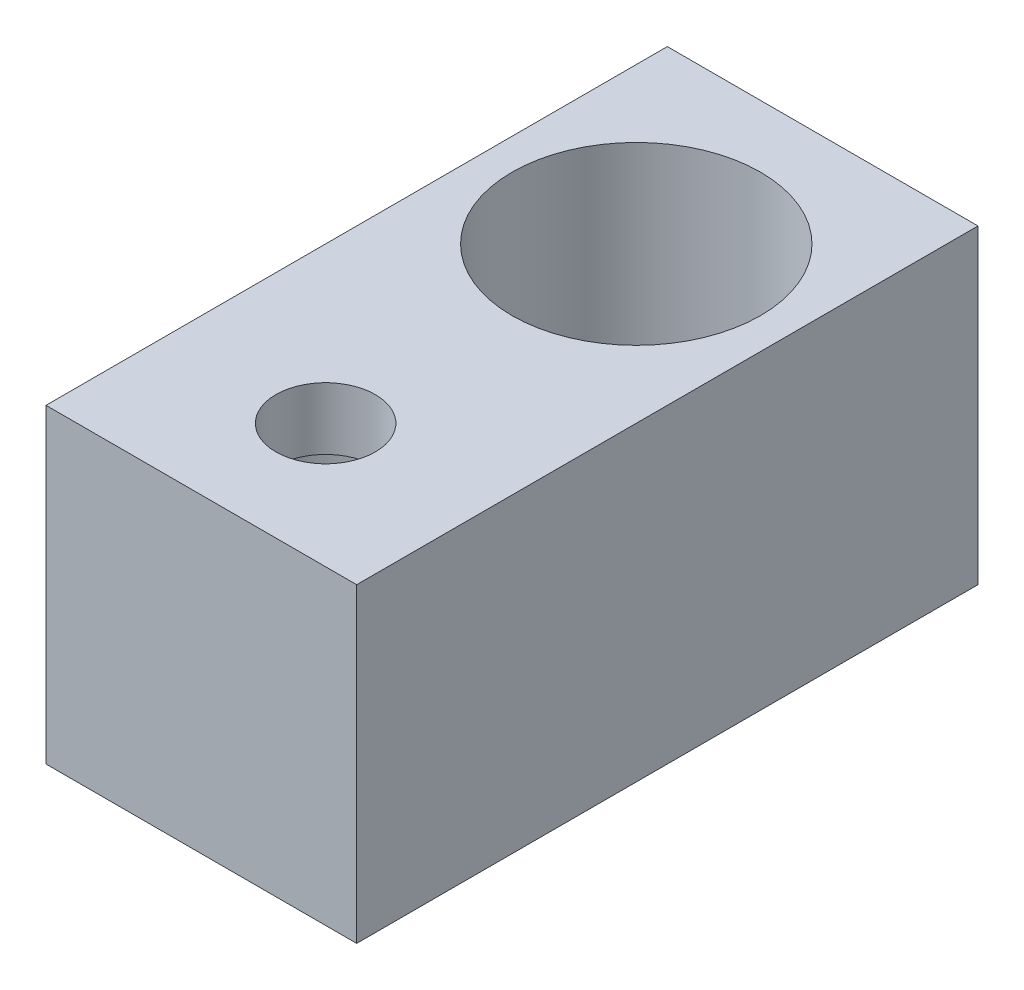
ISO-10303-21;
HEADER;
FILE_DESCRIPTION(('STEP AP214'),'2;1');
FILE_NAME('part.step','',(''),(''),'','','');
FILE_SCHEMA(('AUTOMOTIVE_DESIGN { 1 0 10303 214 1 1 1 1 }'));
ENDSEC;
DATA;
#1=APPLICATION_CONTEXT('core data for automotive mechanical design processes');
#2=APPLICATION_PROTOCOL_DEFINITION('international standard','automotive_design',2000,#1);
#3=PRODUCT_CONTEXT('',#1,'mechanical');
#4=PRODUCT('Part','Part','',(#3));
#5=PRODUCT_RELATED_PRODUCT_CATEGORY('part','',(#4));
#6=PRODUCT_DEFINITION_FORMATION('','',#4);
#7=PRODUCT_DEFINITION_CONTEXT('part definition',#1,'design');
#8=PRODUCT_DEFINITION('design','',#6,#7);
#9=PRODUCT_DEFINITION_SHAPE('','',#8);
#10=(LENGTH_UNIT() NAMED_UNIT(*) SI_UNIT(.MILLI.,.METRE.));
#11=(NAMED_UNIT(*) PLANE_ANGLE_UNIT() SI_UNIT($,.RADIAN.));
#12=(NAMED_UNIT(*) SI_UNIT($,.STERADIAN.) SOLID_ANGLE_UNIT());
#13=UNCERTAINTY_MEASURE_WITH_UNIT(LENGTH_MEASURE(1.E-05),#10,'distance_accuracy_value','');
#14=(GEOMETRIC_REPRESENTATION_CONTEXT(3) GLOBAL_UNCERTAINTY_ASSIGNED_CONTEXT((#13)) GLOBAL_UNIT_ASSIGNED_CONTEXT((#10,
#11,#12)) REPRESENTATION_CONTEXT('',''));
#15=CARTESIAN_POINT('',(0.,0.,0.));
#16=DIRECTION('',(0.,0.,1.));
#17=DIRECTION('',(1.,0.,0.));
#18=AXIS2_PLACEMENT_3D('',#15,#16,#17);
#19=CARTESIAN_POINT('',(5.,10.,16.));
#20=DIRECTION('',(0.,-1.,0.));
#21=DIRECTION('',(0.,0.,-1.));
#22=AXIS2_PLACEMENT_3D('',#19,#20,#21);
#23=CYLINDRICAL_SURFACE('',#22,1.6);
#24=CARTESIAN_POINT('',(5.,10.,16.));
#25=DIRECTION('',(0.,1.,0.));
#26=DIRECTION('',(0.,0.,1.));
#27=AXIS2_PLACEMENT_3D('',#24,#25,#26);
#28=CIRCLE('',#27,1.6);
#29=CARTESIAN_POINT('',(5.,10.,17.6));
#30=VERTEX_POINT('',#29);
#31=EDGE_CURVE('E118',#30,#30,#28,.T.);
#32=ORIENTED_EDGE('',*,*,#31,.T.);
#33=EDGE_LOOP('',(#32));
#34=FACE_BOUND('',#33,.T.);
#35=CARTESIAN_POINT('',(5.,8.,16.));
#36=DIRECTION('',(0.,-1.,0.));
#37=DIRECTION('',(0.,0.,-1.));
#38=AXIS2_PLACEMENT_3D('',#35,#36,#37);
#39=CIRCLE('',#38,1.6);
#40=CARTESIAN_POINT('',(5.,8.,14.4));
#41=VERTEX_POINT('',#40);
#42=EDGE_CURVE('E37',#41,#41,#39,.T.);
#43=ORIENTED_EDGE('',*,*,#42,.T.);
#44=EDGE_LOOP('',(#43));
#45=FACE_BOUND('',#44,.T.);
#46=ADVANCED_FACE('F33',(#34,#45),#23,.F.);
#47=CARTESIAN_POINT('',(0.,10.,0.));
#48=DIRECTION('',(0.,1.,0.));
#49=DIRECTION('',(0.,0.,1.));
#50=AXIS2_PLACEMENT_3D('',#47,#48,#49);
#51=PLANE('',#50);
#52=CARTESIAN_POINT('',(5.,10.,6.));
#53=DIRECTION('',(0.,1.,0.));
#54=DIRECTION('',(0.,0.,1.));
#55=AXIS2_PLACEMENT_3D('',#52,#53,#54);
#56=CIRCLE('',#55,4.);
#57=CARTESIAN_POINT('',(5.,10.,10.));
#58=VERTEX_POINT('',#57);
#59=EDGE_CURVE('E103',#58,#58,#56,.T.);
#60=ORIENTED_EDGE('',*,*,#59,.F.);
#61=EDGE_LOOP('',(#60));
#62=FACE_BOUND('',#61,.T.);
#63=DIRECTION('',(0.,0.,1.));
#64=VECTOR('',#63,1.);
#65=CARTESIAN_POINT('',(0.,10.,0.));
#66=LINE('',#65,#64);
#67=CARTESIAN_POINT('',(0.,10.,0.));
#68=VERTEX_POINT('',#67);
#69=CARTESIAN_POINT('',(0.,10.,20.));
#70=VERTEX_POINT('',#69);
#71=EDGE_CURVE('E87',#68,#70,#66,.T.);
#72=ORIENTED_EDGE('',*,*,#71,.T.);
#73=DIRECTION('',(1.,0.,0.));
#74=VECTOR('',#73,1.);
#75=CARTESIAN_POINT('',(0.,10.,20.));
#76=LINE('',#75,#74);
#77=CARTESIAN_POINT('',(10.,10.,20.));
#78=VERTEX_POINT('',#77);
#79=EDGE_CURVE('E81',#70,#78,#76,.T.);
#80=ORIENTED_EDGE('',*,*,#79,.T.);
#81=DIRECTION('',(0.,0.,-1.));
#82=VECTOR('',#81,1.);
#83=CARTESIAN_POINT('',(10.,10.,0.));
#84=LINE('',#83,#82);
#85=CARTESIAN_POINT('',(10.,10.,0.));
#86=VERTEX_POINT('',#85);
#87=EDGE_CURVE('E85',#78,#86,#84,.T.);
#88=ORIENTED_EDGE('',*,*,#87,.T.);
#89=DIRECTION('',(-1.,0.,0.));
#90=VECTOR('',#89,1.);
#91=CARTESIAN_POINT('',(0.,10.,0.));
#92=LINE('',#91,#90);
#93=EDGE_CURVE('E51',#86,#68,#92,.T.);
#94=ORIENTED_EDGE('',*,*,#93,.T.);
#95=EDGE_LOOP('',(#72,#80,#88,#94));
#96=FACE_BOUND('',#95,.T.);
#97=ORIENTED_EDGE('',*,*,#31,.F.);
#98=EDGE_LOOP('',(#97));
#99=FACE_BOUND('',#98,.T.);
#100=ADVANCED_FACE('F82',(#62,#96,#99),#51,.T.);
#101=CARTESIAN_POINT('',(0.,0.,0.));
#102=DIRECTION('',(0.,1.,0.));
#103=DIRECTION('',(0.,0.,1.));
#104=AXIS2_PLACEMENT_3D('',#101,#102,#103);
#105=PLANE('',#104);
#106=CARTESIAN_POINT('',(5.,0.,16.));
#107=DIRECTION('',(0.,-1.,0.));
#108=DIRECTION('',(0.,0.,-1.));
#109=AXIS2_PLACEMENT_3D('',#106,#107,#108);
#110=CIRCLE('',#109,3.);
#111=CARTESIAN_POINT('',(5.,0.,13.));
#112=VERTEX_POINT('',#111);
#113=EDGE_CURVE('E123',#112,#112,#110,.T.);
#114=ORIENTED_EDGE('',*,*,#113,.F.);
#115=EDGE_LOOP('',(#114));
#116=FACE_BOUND('',#115,.T.);
#117=DIRECTION('',(0.,0.,1.));
#118=VECTOR('',#117,1.);
#119=CARTESIAN_POINT('',(0.,0.,0.));
#120=LINE('',#119,#118);
#121=CARTESIAN_POINT('',(0.,0.,0.));
#122=VERTEX_POINT('',#121);
#123=CARTESIAN_POINT('',(0.,0.,20.));
#124=VERTEX_POINT('',#123);
#125=EDGE_CURVE('E100',#122,#124,#120,.T.);
#126=ORIENTED_EDGE('',*,*,#125,.F.);
#127=DIRECTION('',(-1.,0.,0.));
#128=VECTOR('',#127,1.);
#129=CARTESIAN_POINT('',(0.,0.,0.));
#130=LINE('',#129,#128);
#131=CARTESIAN_POINT('',(10.,0.,0.));
#132=VERTEX_POINT('',#131);
#133=EDGE_CURVE('E74',#132,#122,#130,.T.);
#134=ORIENTED_EDGE('',*,*,#133,.F.);
#135=DIRECTION('',(0.,0.,-1.));
#136=VECTOR('',#135,1.);
#137=CARTESIAN_POINT('',(10.,0.,0.));
#138=LINE('',#137,#136);
#139=CARTESIAN_POINT('',(10.,0.,20.));
#140=VERTEX_POINT('',#139);
#141=EDGE_CURVE('E68',#140,#132,#138,.T.);
#142=ORIENTED_EDGE('',*,*,#141,.F.);
#143=DIRECTION('',(1.,0.,0.));
#144=VECTOR('',#143,1.);
#145=CARTESIAN_POINT('',(0.,0.,20.));
#146=LINE('',#145,#144);
#147=EDGE_CURVE('E91',#124,#140,#146,.T.);
#148=ORIENTED_EDGE('',*,*,#147,.F.);
#149=EDGE_LOOP('',(#126,#134,#142,#148));
#150=FACE_BOUND('',#149,.T.);
#151=CARTESIAN_POINT('',(5.,0.,6.));
#152=DIRECTION('',(0.,1.,0.));
#153=DIRECTION('',(0.,0.,1.));
#154=AXIS2_PLACEMENT_3D('',#151,#152,#153);
#155=CIRCLE('',#154,4.);
#156=CARTESIAN_POINT('',(5.,0.,10.));
#157=VERTEX_POINT('',#156);
#158=EDGE_CURVE('E115',#157,#157,#155,.T.);
#159=ORIENTED_EDGE('',*,*,#158,.T.);
#160=EDGE_LOOP('',(#159));
#161=FACE_BOUND('',#160,.T.);
#162=ADVANCED_FACE('F111',(#116,#150,#161),#105,.F.);
#163=CARTESIAN_POINT('',(0.,10.,0.));
#164=DIRECTION('',(1.,0.,0.));
#165=DIRECTION('',(0.,0.,-1.));
#166=AXIS2_PLACEMENT_3D('',#163,#164,#165);
#167=PLANE('',#166);
#168=ORIENTED_EDGE('',*,*,#125,.T.);
#169=DIRECTION('',(0.,-1.,0.));
#170=VECTOR('',#169,1.);
#171=CARTESIAN_POINT('',(0.,10.,20.));
#172=LINE('',#171,#170);
#173=EDGE_CURVE('E11',#70,#124,#172,.T.);
#174=ORIENTED_EDGE('',*,*,#173,.F.);
#175=ORIENTED_EDGE('',*,*,#71,.F.);
#176=DIRECTION('',(0.,-1.,0.));
#177=VECTOR('',#176,1.);
#178=CARTESIAN_POINT('',(0.,10.,0.));
#179=LINE('',#178,#177);
#180=EDGE_CURVE('E96',#68,#122,#179,.T.);
#181=ORIENTED_EDGE('',*,*,#180,.T.);
#182=EDGE_LOOP('',(#168,#174,#175,#181));
#183=FACE_BOUND('',#182,.T.);
#184=ADVANCED_FACE('F35',(#183),#167,.F.);
#185=CARTESIAN_POINT('',(0.,10.,20.));
#186=DIRECTION('',(0.,0.,-1.));
#187=DIRECTION('',(-1.,0.,0.));
#188=AXIS2_PLACEMENT_3D('',#185,#186,#187);
#189=PLANE('',#188);
#190=ORIENTED_EDGE('',*,*,#147,.T.);
#191=DIRECTION('',(0.,-1.,0.));
#192=VECTOR('',#191,1.);
#193=CARTESIAN_POINT('',(10.,10.,20.));
#194=LINE('',#193,#192);
#195=EDGE_CURVE('E43',#78,#140,#194,.T.);
#196=ORIENTED_EDGE('',*,*,#195,.F.);
#197=ORIENTED_EDGE('',*,*,#79,.F.);
#198=ORIENTED_EDGE('',*,*,#173,.T.);
#199=EDGE_LOOP('',(#190,#196,#197,#198));
#200=FACE_BOUND('',#199,.T.);
#201=ADVANCED_FACE('F90',(#200),#189,.F.);
#202=CARTESIAN_POINT('',(10.,10.,0.));
#203=DIRECTION('',(-1.,0.,0.));
#204=DIRECTION('',(0.,0.,1.));
#205=AXIS2_PLACEMENT_3D('',#202,#203,#204);
#206=PLANE('',#205);
#207=ORIENTED_EDGE('',*,*,#141,.T.);
#208=DIRECTION('',(0.,-1.,0.));
#209=VECTOR('',#208,1.);
#210=CARTESIAN_POINT('',(10.,10.,0.));
#211=LINE('',#210,#209);
#212=EDGE_CURVE('E92',#86,#132,#211,.T.);
#213=ORIENTED_EDGE('',*,*,#212,.F.);
#214=ORIENTED_EDGE('',*,*,#87,.F.);
#215=ORIENTED_EDGE('',*,*,#195,.T.);
#216=EDGE_LOOP('',(#207,#213,#214,#215));
#217=FACE_BOUND('',#216,.T.);
#218=ADVANCED_FACE('F94',(#217),#206,.F.);
#219=CARTESIAN_POINT('',(0.,10.,0.));
#220=DIRECTION('',(0.,0.,1.));
#221=DIRECTION('',(1.,0.,0.));
#222=AXIS2_PLACEMENT_3D('',#219,#220,#221);
#223=PLANE('',#222);
#224=ORIENTED_EDGE('',*,*,#133,.T.);
#225=ORIENTED_EDGE('',*,*,#180,.F.);
#226=ORIENTED_EDGE('',*,*,#93,.F.);
#227=ORIENTED_EDGE('',*,*,#212,.T.);
#228=EDGE_LOOP('',(#224,#225,#226,#227));
#229=FACE_BOUND('',#228,.T.);
#230=ADVANCED_FACE('F108',(#229),#223,.F.);
#231=CARTESIAN_POINT('',(5.,10.,6.));
#232=DIRECTION('',(0.,-1.,0.));
#233=DIRECTION('',(0.,0.,-1.));
#234=AXIS2_PLACEMENT_3D('',#231,#232,#233);
#235=CYLINDRICAL_SURFACE('',#234,4.);
#236=ORIENTED_EDGE('',*,*,#59,.T.);
#237=EDGE_LOOP('',(#236));
#238=FACE_BOUND('',#237,.T.);
#239=ORIENTED_EDGE('',*,*,#158,.F.);
#240=EDGE_LOOP('',(#239));
#241=FACE_BOUND('',#240,.T.);
#242=ADVANCED_FACE('F141',(#238,#241),#235,.F.);
#243=CARTESIAN_POINT('',(5.,8.,16.));
#244=DIRECTION('',(0.,-1.,0.));
#245=DIRECTION('',(0.,0.,-1.));
#246=AXIS2_PLACEMENT_3D('',#243,#244,#245);
#247=CYLINDRICAL_SURFACE('',#246,3.);
#248=CARTESIAN_POINT('',(5.,8.,16.));
#249=DIRECTION('',(0.,-1.,0.));
#250=DIRECTION('',(0.,0.,-1.));
#251=AXIS2_PLACEMENT_3D('',#248,#249,#250);
#252=CIRCLE('',#251,3.);
#253=CARTESIAN_POINT('',(5.,8.,13.));
#254=VERTEX_POINT('',#253);
#255=EDGE_CURVE('E126',#254,#254,#252,.T.);
#256=ORIENTED_EDGE('',*,*,#255,.F.);
#257=EDGE_LOOP('',(#256));
#258=FACE_BOUND('',#257,.T.);
#259=ORIENTED_EDGE('',*,*,#113,.T.);
#260=EDGE_LOOP('',(#259));
#261=FACE_BOUND('',#260,.T.);
#262=ADVANCED_FACE('F136',(#258,#261),#247,.F.);
#263=CARTESIAN_POINT('',(5.,8.,16.));
#264=DIRECTION('',(0.,-1.,0.));
#265=DIRECTION('',(0.,0.,-1.));
#266=AXIS2_PLACEMENT_3D('',#263,#264,#265);
#267=PLANE('',#266);
#268=ORIENTED_EDGE('',*,*,#42,.F.);
#269=EDGE_LOOP('',(#268));
#270=FACE_BOUND('',#269,.T.);
#271=ORIENTED_EDGE('',*,*,#255,.T.);
#272=EDGE_LOOP('',(#271));
#273=FACE_BOUND('',#272,.T.);
#274=ADVANCED_FACE('F134',(#270,#273),#267,.T.);
#275=CLOSED_SHELL('',(#46,#100,#162,#184,#201,#218,#230,#242,#262,#274));
#276=MANIFOLD_SOLID_BREP('B2',#275);
#277=ADVANCED_BREP_SHAPE_REPRESENTATION('',(#18,#276),#14);
#278=SHAPE_DEFINITION_REPRESENTATION(#9,#277);
ENDSEC;
END-ISO-10303-21;
